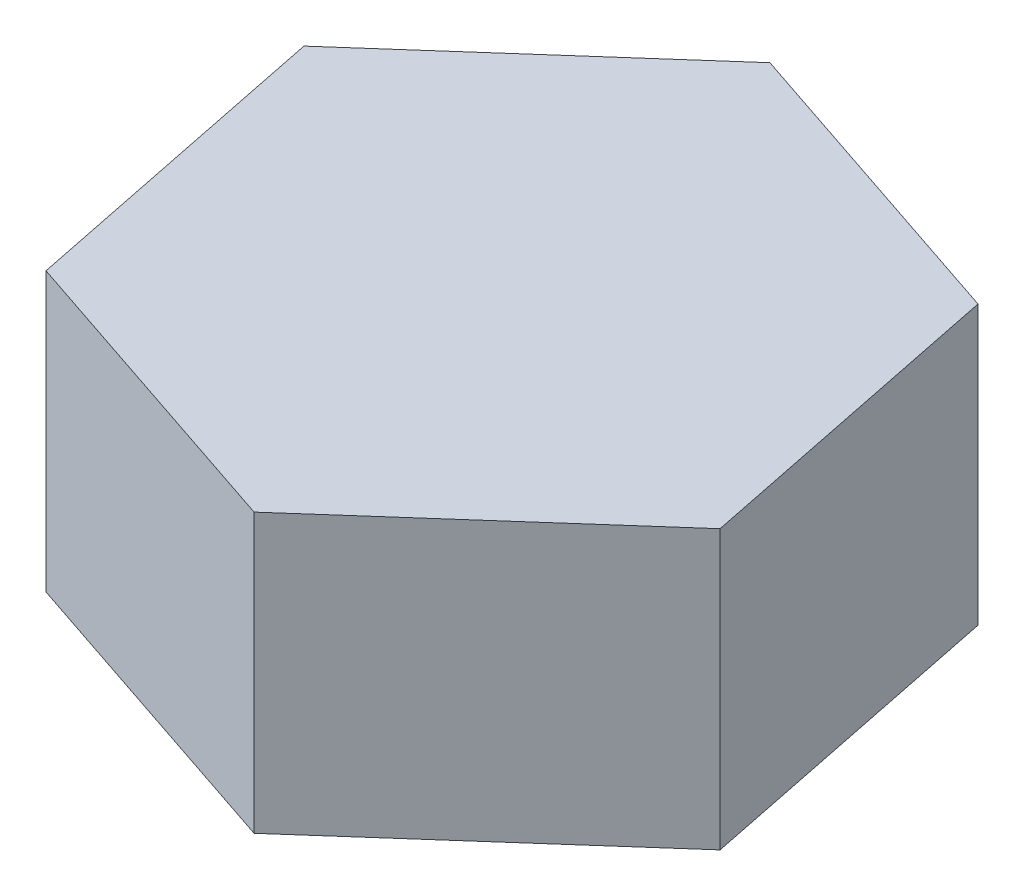
ISO-10303-21;
HEADER;
FILE_DESCRIPTION(('STEP AP214'),'2;1');
FILE_NAME('part.step','',(''),(''),'','','');
FILE_SCHEMA(('AUTOMOTIVE_DESIGN { 1 0 10303 214 1 1 1 1 }'));
ENDSEC;
DATA;
#1=APPLICATION_CONTEXT('core data for automotive mechanical design processes');
#2=APPLICATION_PROTOCOL_DEFINITION('international standard','automotive_design',2000,#1);
#3=PRODUCT_CONTEXT('',#1,'mechanical');
#4=PRODUCT('Part','Part','',(#3));
#5=PRODUCT_RELATED_PRODUCT_CATEGORY('part','',(#4));
#6=PRODUCT_DEFINITION_FORMATION('','',#4);
#7=PRODUCT_DEFINITION_CONTEXT('part definition',#1,'design');
#8=PRODUCT_DEFINITION('design','',#6,#7);
#9=PRODUCT_DEFINITION_SHAPE('','',#8);
#10=(LENGTH_UNIT() NAMED_UNIT(*) SI_UNIT(.MILLI.,.METRE.));
#11=(NAMED_UNIT(*) PLANE_ANGLE_UNIT() SI_UNIT($,.RADIAN.));
#12=(NAMED_UNIT(*) SI_UNIT($,.STERADIAN.) SOLID_ANGLE_UNIT());
#13=UNCERTAINTY_MEASURE_WITH_UNIT(LENGTH_MEASURE(1.E-05),#10,'distance_accuracy_value','');
#14=(GEOMETRIC_REPRESENTATION_CONTEXT(3) GLOBAL_UNCERTAINTY_ASSIGNED_CONTEXT((#13)) GLOBAL_UNIT_ASSIGNED_CONTEXT((#10,
#11,#12)) REPRESENTATION_CONTEXT('',''));
#15=CARTESIAN_POINT('',(0.,0.,0.));
#16=DIRECTION('',(0.,0.,1.));
#17=DIRECTION('',(1.,0.,0.));
#18=AXIS2_PLACEMENT_3D('',#15,#16,#17);
#19=CARTESIAN_POINT('',(2.02541354685856,1.8,0.678994324906958));
#20=DIRECTION('',(-0.980039636860258,0.,0.198802188576517));
#21=DIRECTION('',(0.198802188576517,0.,0.980039636860258));
#22=AXIS2_PLACEMENT_3D('',#19,#20,#21);
#23=PLANE('',#22);
#24=DIRECTION('',(-0.198802188576517,0.,-0.980039636860258));
#25=VECTOR('',#24,1.);
#26=CARTESIAN_POINT('',(2.02541354685856,0.,0.678994324906958));
#27=LINE('',#26,#25);
#28=CARTESIAN_POINT('',(2.02541354685856,0.,0.678994324906958));
#29=VERTEX_POINT('',#28);
#30=CARTESIAN_POINT('',(1.60073310782417,0.,-1.41456242229518));
#31=VERTEX_POINT('',#30);
#32=EDGE_CURVE('E122',#29,#31,#27,.T.);
#33=ORIENTED_EDGE('',*,*,#32,.T.);
#34=DIRECTION('',(0.,-1.,0.));
#35=VECTOR('',#34,1.);
#36=CARTESIAN_POINT('',(1.60073310782417,1.8,-1.41456242229518));
#37=LINE('',#36,#35);
#38=CARTESIAN_POINT('',(1.60073310782417,1.8,-1.41456242229518));
#39=VERTEX_POINT('',#38);
#40=EDGE_CURVE('E11',#39,#31,#37,.T.);
#41=ORIENTED_EDGE('',*,*,#40,.F.);
#42=DIRECTION('',(-0.198802188576517,0.,-0.980039636860258));
#43=VECTOR('',#42,1.);
#44=CARTESIAN_POINT('',(2.02541354685856,1.8,0.678994324906958));
#45=LINE('',#44,#43);
#46=CARTESIAN_POINT('',(2.02541354685856,1.8,0.678994324906958));
#47=VERTEX_POINT('',#46);
#48=EDGE_CURVE('E132',#47,#39,#45,.T.);
#49=ORIENTED_EDGE('',*,*,#48,.F.);
#50=DIRECTION('',(0.,-1.,0.));
#51=VECTOR('',#50,1.);
#52=CARTESIAN_POINT('',(2.02541354685856,1.8,0.678994324906958));
#53=LINE('',#52,#51);
#54=EDGE_CURVE('E118',#47,#29,#53,.T.);
#55=ORIENTED_EDGE('',*,*,#54,.T.);
#56=EDGE_LOOP('',(#33,#41,#49,#55));
#57=FACE_BOUND('',#56,.T.);
#58=ADVANCED_FACE('F38',(#57),#23,.F.);
#59=CARTESIAN_POINT('',(1.60073310782417,1.8,-1.41456242229518));
#60=DIRECTION('',(-0.317852072794921,0.,0.948140316524918));
#61=DIRECTION('',(0.948140316524918,0.,0.317852072794921));
#62=AXIS2_PLACEMENT_3D('',#59,#60,#61);
#63=PLANE('',#62);
#64=DIRECTION('',(-0.948140316524918,0.,-0.317852072794921));
#65=VECTOR('',#64,1.);
#66=CARTESIAN_POINT('',(1.60073310782417,0.,-1.41456242229518));
#67=LINE('',#66,#65);
#68=CARTESIAN_POINT('',(-0.42468043903439,0.,-2.09355674720214));
#69=VERTEX_POINT('',#68);
#70=EDGE_CURVE('E125',#31,#69,#67,.T.);
#71=ORIENTED_EDGE('',*,*,#70,.T.);
#72=DIRECTION('',(0.,-1.,0.));
#73=VECTOR('',#72,1.);
#74=CARTESIAN_POINT('',(-0.42468043903439,1.8,-2.09355674720214));
#75=LINE('',#74,#73);
#76=CARTESIAN_POINT('',(-0.42468043903439,1.8,-2.09355674720214));
#77=VERTEX_POINT('',#76);
#78=EDGE_CURVE('E46',#77,#69,#75,.T.);
#79=ORIENTED_EDGE('',*,*,#78,.F.);
#80=DIRECTION('',(-0.948140316524918,0.,-0.317852072794921));
#81=VECTOR('',#80,1.);
#82=CARTESIAN_POINT('',(1.60073310782417,1.8,-1.41456242229518));
#83=LINE('',#82,#81);
#84=EDGE_CURVE('E91',#39,#77,#83,.T.);
#85=ORIENTED_EDGE('',*,*,#84,.F.);
#86=ORIENTED_EDGE('',*,*,#40,.T.);
#87=EDGE_LOOP('',(#71,#79,#85,#86));
#88=FACE_BOUND('',#87,.T.);
#89=ADVANCED_FACE('F156',(#88),#63,.F.);
#90=CARTESIAN_POINT('',(-0.42468043903439,1.8,-2.09355674720214));
#91=DIRECTION('',(0.662187564065338,0.,0.749338127948401));
#92=DIRECTION('',(0.749338127948401,0.,-0.662187564065338));
#93=AXIS2_PLACEMENT_3D('',#90,#91,#92);
#94=PLANE('',#93);
#95=DIRECTION('',(-0.749338127948401,0.,0.662187564065338));
#96=VECTOR('',#95,1.);
#97=CARTESIAN_POINT('',(-0.42468043903439,0.,-2.09355674720214));
#98=LINE('',#97,#96);
#99=CARTESIAN_POINT('',(-2.02541354685856,0.,-0.678994324906957));
#100=VERTEX_POINT('',#99);
#101=EDGE_CURVE('E127',#69,#100,#98,.T.);
#102=ORIENTED_EDGE('',*,*,#101,.T.);
#103=DIRECTION('',(0.,-1.,0.));
#104=VECTOR('',#103,1.);
#105=CARTESIAN_POINT('',(-2.02541354685856,1.8,-0.678994324906957));
#106=LINE('',#105,#104);
#107=CARTESIAN_POINT('',(-2.02541354685856,1.8,-0.678994324906957));
#108=VERTEX_POINT('',#107);
#109=EDGE_CURVE('E113',#108,#100,#106,.T.);
#110=ORIENTED_EDGE('',*,*,#109,.F.);
#111=DIRECTION('',(-0.749338127948401,0.,0.662187564065338));
#112=VECTOR('',#111,1.);
#113=CARTESIAN_POINT('',(-0.42468043903439,1.8,-2.09355674720214));
#114=LINE('',#113,#112);
#115=EDGE_CURVE('E104',#77,#108,#114,.T.);
#116=ORIENTED_EDGE('',*,*,#115,.F.);
#117=ORIENTED_EDGE('',*,*,#78,.T.);
#118=EDGE_LOOP('',(#102,#110,#116,#117));
#119=FACE_BOUND('',#118,.T.);
#120=ADVANCED_FACE('F138',(#119),#94,.F.);
#121=CARTESIAN_POINT('',(-2.02541354685856,1.8,-0.678994324906957));
#122=DIRECTION('',(0.980039636860258,0.,-0.198802188576518));
#123=DIRECTION('',(-0.198802188576518,0.,-0.980039636860258));
#124=AXIS2_PLACEMENT_3D('',#121,#122,#123);
#125=PLANE('',#124);
#126=DIRECTION('',(0.198802188576518,0.,0.980039636860258));
#127=VECTOR('',#126,1.);
#128=CARTESIAN_POINT('',(-2.02541354685856,0.,-0.678994324906957));
#129=LINE('',#128,#127);
#130=CARTESIAN_POINT('',(-1.60073310782417,0.,1.41456242229518));
#131=VERTEX_POINT('',#130);
#132=EDGE_CURVE('E112',#100,#131,#129,.T.);
#133=ORIENTED_EDGE('',*,*,#132,.T.);
#134=DIRECTION('',(0.,-1.,0.));
#135=VECTOR('',#134,1.);
#136=CARTESIAN_POINT('',(-1.60073310782417,1.8,1.41456242229518));
#137=LINE('',#136,#135);
#138=CARTESIAN_POINT('',(-1.60073310782417,1.8,1.41456242229518));
#139=VERTEX_POINT('',#138);
#140=EDGE_CURVE('E109',#139,#131,#137,.T.);
#141=ORIENTED_EDGE('',*,*,#140,.F.);
#142=DIRECTION('',(0.198802188576518,0.,0.980039636860258));
#143=VECTOR('',#142,1.);
#144=CARTESIAN_POINT('',(-2.02541354685856,1.8,-0.678994324906957));
#145=LINE('',#144,#143);
#146=EDGE_CURVE('E98',#108,#139,#145,.T.);
#147=ORIENTED_EDGE('',*,*,#146,.F.);
#148=ORIENTED_EDGE('',*,*,#109,.T.);
#149=EDGE_LOOP('',(#133,#141,#147,#148));
#150=FACE_BOUND('',#149,.T.);
#151=ADVANCED_FACE('F110',(#150),#125,.F.);
#152=CARTESIAN_POINT('',(-1.60073310782417,1.8,1.41456242229518));
#153=DIRECTION('',(0.317852072794921,0.,-0.948140316524918));
#154=DIRECTION('',(-0.948140316524918,0.,-0.317852072794921));
#155=AXIS2_PLACEMENT_3D('',#152,#153,#154);
#156=PLANE('',#155);
#157=DIRECTION('',(0.948140316524918,0.,0.317852072794921));
#158=VECTOR('',#157,1.);
#159=CARTESIAN_POINT('',(-1.60073310782417,0.,1.41456242229518));
#160=LINE('',#159,#158);
#161=CARTESIAN_POINT('',(0.424680439034392,0.,2.09355674720214));
#162=VERTEX_POINT('',#161);
#163=EDGE_CURVE('E77',#131,#162,#160,.T.);
#164=ORIENTED_EDGE('',*,*,#163,.T.);
#165=DIRECTION('',(0.,-1.,0.));
#166=VECTOR('',#165,1.);
#167=CARTESIAN_POINT('',(0.424680439034392,1.8,2.09355674720214));
#168=LINE('',#167,#166);
#169=CARTESIAN_POINT('',(0.424680439034392,1.8,2.09355674720214));
#170=VERTEX_POINT('',#169);
#171=EDGE_CURVE('E114',#170,#162,#168,.T.);
#172=ORIENTED_EDGE('',*,*,#171,.F.);
#173=DIRECTION('',(0.948140316524918,0.,0.317852072794921));
#174=VECTOR('',#173,1.);
#175=CARTESIAN_POINT('',(-1.60073310782417,1.8,1.41456242229518));
#176=LINE('',#175,#174);
#177=EDGE_CURVE('E102',#139,#170,#176,.T.);
#178=ORIENTED_EDGE('',*,*,#177,.F.);
#179=ORIENTED_EDGE('',*,*,#140,.T.);
#180=EDGE_LOOP('',(#164,#172,#178,#179));
#181=FACE_BOUND('',#180,.T.);
#182=ADVANCED_FACE('F116',(#181),#156,.F.);
#183=CARTESIAN_POINT('',(0.424680439034392,1.8,2.09355674720214));
#184=DIRECTION('',(-0.662187564065338,0.,-0.749338127948401));
#185=DIRECTION('',(-0.749338127948401,0.,0.662187564065338));
#186=AXIS2_PLACEMENT_3D('',#183,#184,#185);
#187=PLANE('',#186);
#188=DIRECTION('',(0.749338127948401,0.,-0.662187564065338));
#189=VECTOR('',#188,1.);
#190=CARTESIAN_POINT('',(0.424680439034392,0.,2.09355674720214));
#191=LINE('',#190,#189);
#192=EDGE_CURVE('E83',#162,#29,#191,.T.);
#193=ORIENTED_EDGE('',*,*,#192,.T.);
#194=ORIENTED_EDGE('',*,*,#54,.F.);
#195=DIRECTION('',(0.749338127948401,0.,-0.662187564065338));
#196=VECTOR('',#195,1.);
#197=CARTESIAN_POINT('',(0.424680439034392,1.8,2.09355674720214));
#198=LINE('',#197,#196);
#199=EDGE_CURVE('E54',#170,#47,#198,.T.);
#200=ORIENTED_EDGE('',*,*,#199,.F.);
#201=ORIENTED_EDGE('',*,*,#171,.T.);
#202=EDGE_LOOP('',(#193,#194,#200,#201));
#203=FACE_BOUND('',#202,.T.);
#204=ADVANCED_FACE('F145',(#203),#187,.F.);
#205=CARTESIAN_POINT('',(0.,1.8,0.));
#206=DIRECTION('',(0.,1.,0.));
#207=DIRECTION('',(0.,0.,1.));
#208=AXIS2_PLACEMENT_3D('',#205,#206,#207);
#209=PLANE('',#208);
#210=ORIENTED_EDGE('',*,*,#48,.T.);
#211=ORIENTED_EDGE('',*,*,#84,.T.);
#212=ORIENTED_EDGE('',*,*,#115,.T.);
#213=ORIENTED_EDGE('',*,*,#146,.T.);
#214=ORIENTED_EDGE('',*,*,#177,.T.);
#215=ORIENTED_EDGE('',*,*,#199,.T.);
#216=EDGE_LOOP('',(#210,#211,#212,#213,#214,#215));
#217=FACE_BOUND('',#216,.T.);
#218=ADVANCED_FACE('F100',(#217),#209,.T.);
#219=CARTESIAN_POINT('',(0.,0.,0.));
#220=DIRECTION('',(0.,1.,0.));
#221=DIRECTION('',(0.,0.,1.));
#222=AXIS2_PLACEMENT_3D('',#219,#220,#221);
#223=PLANE('',#222);
#224=ORIENTED_EDGE('',*,*,#32,.F.);
#225=ORIENTED_EDGE('',*,*,#192,.F.);
#226=ORIENTED_EDGE('',*,*,#163,.F.);
#227=ORIENTED_EDGE('',*,*,#132,.F.);
#228=ORIENTED_EDGE('',*,*,#101,.F.);
#229=ORIENTED_EDGE('',*,*,#70,.F.);
#230=EDGE_LOOP('',(#224,#225,#226,#227,#228,#229));
#231=FACE_BOUND('',#230,.T.);
#232=ADVANCED_FACE('F141',(#231),#223,.F.);
#233=CLOSED_SHELL('',(#58,#89,#120,#151,#182,#204,#218,#232));
#234=MANIFOLD_SOLID_BREP('B2',#233);
#235=ADVANCED_BREP_SHAPE_REPRESENTATION('',(#18,#234),#14);
#236=SHAPE_DEFINITION_REPRESENTATION(#9,#235);
ENDSEC;
END-ISO-10303-21;
